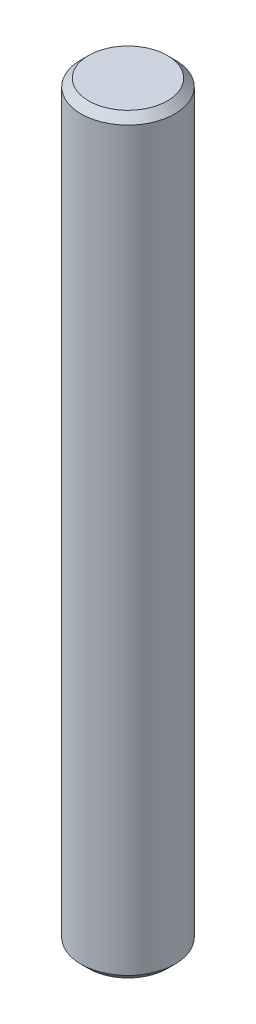
ISO-10303-21;
HEADER;
FILE_DESCRIPTION(('STEP AP214'),'2;1');
FILE_NAME('part.step','',(''),(''),'','','');
FILE_SCHEMA(('AUTOMOTIVE_DESIGN { 1 0 10303 214 1 1 1 1 }'));
ENDSEC;
DATA;
#1=APPLICATION_CONTEXT('core data for automotive mechanical design processes');
#2=APPLICATION_PROTOCOL_DEFINITION('international standard','automotive_design',2000,#1);
#3=PRODUCT_CONTEXT('',#1,'mechanical');
#4=PRODUCT('Part','Part','',(#3));
#5=PRODUCT_RELATED_PRODUCT_CATEGORY('part','',(#4));
#6=PRODUCT_DEFINITION_FORMATION('','',#4);
#7=PRODUCT_DEFINITION_CONTEXT('part definition',#1,'design');
#8=PRODUCT_DEFINITION('design','',#6,#7);
#9=PRODUCT_DEFINITION_SHAPE('','',#8);
#10=(LENGTH_UNIT() NAMED_UNIT(*) SI_UNIT(.MILLI.,.METRE.));
#11=(NAMED_UNIT(*) PLANE_ANGLE_UNIT() SI_UNIT($,.RADIAN.));
#12=(NAMED_UNIT(*) SI_UNIT($,.STERADIAN.) SOLID_ANGLE_UNIT());
#13=UNCERTAINTY_MEASURE_WITH_UNIT(LENGTH_MEASURE(1.E-05),#10,'distance_accuracy_value','');
#14=(GEOMETRIC_REPRESENTATION_CONTEXT(3) GLOBAL_UNCERTAINTY_ASSIGNED_CONTEXT((#13)) GLOBAL_UNIT_ASSIGNED_CONTEXT((#10,
#11,#12)) REPRESENTATION_CONTEXT('',''));
#15=CARTESIAN_POINT('',(0.,0.,0.));
#16=DIRECTION('',(0.,0.,1.));
#17=DIRECTION('',(1.,0.,0.));
#18=AXIS2_PLACEMENT_3D('',#15,#16,#17);
#19=CARTESIAN_POINT('',(-2.84217017566743E-11,0.507999999999995,0.));
#20=DIRECTION('',(0.,1.,0.));
#21=DIRECTION('',(0.,0.,1.));
#22=AXIS2_PLACEMENT_3D('',#19,#20,#21);
#23=CONICAL_SURFACE('',#22,3.17118999993586,0.785398163397448);
#24=CARTESIAN_POINT('',(-2.84217017566743E-11,2.84217017566743E-11,0.));
#25=DIRECTION('',(0.,1.,0.));
#26=DIRECTION('',(0.,0.,1.));
#27=AXIS2_PLACEMENT_3D('',#24,#25,#26);
#28=CIRCLE('',#27,2.66318999996429);
#29=CARTESIAN_POINT('',(-2.84217017566743E-11,2.84217017566743E-11,2.66318999996429));
#30=VERTEX_POINT('',#29);
#31=EDGE_CURVE('E45',#30,#30,#28,.T.);
#32=ORIENTED_EDGE('',*,*,#31,.T.);
#33=EDGE_LOOP('',(#32));
#34=FACE_BOUND('',#33,.T.);
#35=CARTESIAN_POINT('',(-2.84217017566743E-11,0.507999999999995,0.));
#36=DIRECTION('',(0.,1.,0.));
#37=DIRECTION('',(0.,0.,1.));
#38=AXIS2_PLACEMENT_3D('',#35,#36,#37);
#39=CIRCLE('',#38,3.17118999993586);
#40=CARTESIAN_POINT('',(-2.84217017566743E-11,0.507999999999995,3.17118999993586));
#41=VERTEX_POINT('',#40);
#42=EDGE_CURVE('E10',#41,#41,#39,.T.);
#43=ORIENTED_EDGE('',*,*,#42,.F.);
#44=EDGE_LOOP('',(#43));
#45=FACE_BOUND('',#44,.T.);
#46=ADVANCED_FACE('F31',(#34,#45),#23,.T.);
#47=CARTESIAN_POINT('',(-2.84217017566743E-11,2.84217017566743E-11,0.));
#48=DIRECTION('',(0.,1.,0.));
#49=DIRECTION('',(0.,0.,1.));
#50=AXIS2_PLACEMENT_3D('',#47,#48,#49);
#51=CYLINDRICAL_SURFACE('',#50,3.17118999993586);
#52=ORIENTED_EDGE('',*,*,#42,.T.);
#53=EDGE_LOOP('',(#52));
#54=FACE_BOUND('',#53,.T.);
#55=CARTESIAN_POINT('',(-2.84217017566743E-11,50.2920000000591,0.));
#56=DIRECTION('',(0.,1.,0.));
#57=DIRECTION('',(0.,0.,1.));
#58=AXIS2_PLACEMENT_3D('',#55,#56,#57);
#59=CIRCLE('',#58,3.17118999993587);
#60=CARTESIAN_POINT('',(-2.84217017566743E-11,50.2920000000591,3.17118999993587));
#61=VERTEX_POINT('',#60);
#62=EDGE_CURVE('E37',#61,#61,#59,.T.);
#63=ORIENTED_EDGE('',*,*,#62,.F.);
#64=EDGE_LOOP('',(#63));
#65=FACE_BOUND('',#64,.T.);
#66=ADVANCED_FACE('F64',(#54,#65),#51,.T.);
#67=CARTESIAN_POINT('',(-2.84217017566743E-11,50.7999999999905,0.));
#68=DIRECTION('',(0.,-1.,0.));
#69=DIRECTION('',(0.,0.,-1.));
#70=AXIS2_PLACEMENT_3D('',#67,#68,#69);
#71=CONICAL_SURFACE('',#70,2.66319000000438,0.785398163397447);
#72=ORIENTED_EDGE('',*,*,#62,.T.);
#73=EDGE_LOOP('',(#72));
#74=FACE_BOUND('',#73,.T.);
#75=CARTESIAN_POINT('',(-2.84217017566743E-11,50.7999999999905,0.));
#76=DIRECTION('',(0.,1.,0.));
#77=DIRECTION('',(0.,0.,1.));
#78=AXIS2_PLACEMENT_3D('',#75,#76,#77);
#79=CIRCLE('',#78,2.66319000000438);
#80=CARTESIAN_POINT('',(-2.84217017566743E-11,50.7999999999905,2.66319000000438));
#81=VERTEX_POINT('',#80);
#82=EDGE_CURVE('E41',#81,#81,#79,.T.);
#83=ORIENTED_EDGE('',*,*,#82,.F.);
#84=EDGE_LOOP('',(#83));
#85=FACE_BOUND('',#84,.T.);
#86=ADVANCED_FACE('F60',(#74,#85),#71,.T.);
#87=CARTESIAN_POINT('',(-2.84217017566743E-11,50.7999999999905,0.));
#88=DIRECTION('',(0.,1.,0.));
#89=DIRECTION('',(0.,0.,1.));
#90=AXIS2_PLACEMENT_3D('',#87,#88,#89);
#91=PLANE('',#90);
#92=ORIENTED_EDGE('',*,*,#82,.T.);
#93=EDGE_LOOP('',(#92));
#94=FACE_BOUND('',#93,.T.);
#95=ADVANCED_FACE('F55',(#94),#91,.T.);
#96=CARTESIAN_POINT('',(2.66318999993587,2.84217017566743E-11,0.));
#97=DIRECTION('',(0.,-1.,0.));
#98=DIRECTION('',(0.,0.,-1.));
#99=AXIS2_PLACEMENT_3D('',#96,#97,#98);
#100=PLANE('',#99);
#101=ORIENTED_EDGE('',*,*,#31,.F.);
#102=EDGE_LOOP('',(#101));
#103=FACE_BOUND('',#102,.T.);
#104=ADVANCED_FACE('F53',(#103),#100,.T.);
#105=CLOSED_SHELL('',(#46,#66,#86,#95,#104));
#106=MANIFOLD_SOLID_BREP('B2',#105);
#107=ADVANCED_BREP_SHAPE_REPRESENTATION('',(#18,#106),#14);
#108=SHAPE_DEFINITION_REPRESENTATION(#9,#107);
ENDSEC;
END-ISO-10303-21;
